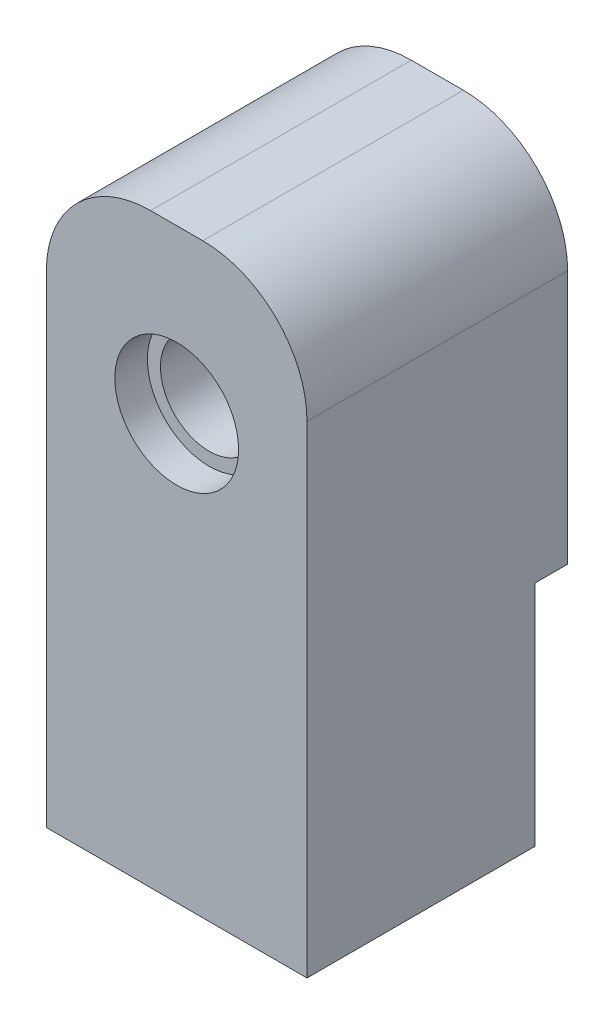
ISO-10303-21;
HEADER;
FILE_DESCRIPTION(('STEP AP214'),'2;1');
FILE_NAME('part.step','',(''),(''),'','','');
FILE_SCHEMA(('AUTOMOTIVE_DESIGN { 1 0 10303 214 1 1 1 1 }'));
ENDSEC;
DATA;
#1=APPLICATION_CONTEXT('core data for automotive mechanical design processes');
#2=APPLICATION_PROTOCOL_DEFINITION('international standard','automotive_design',2000,#1);
#3=PRODUCT_CONTEXT('',#1,'mechanical');
#4=PRODUCT('Part','Part','',(#3));
#5=PRODUCT_RELATED_PRODUCT_CATEGORY('part','',(#4));
#6=PRODUCT_DEFINITION_FORMATION('','',#4);
#7=PRODUCT_DEFINITION_CONTEXT('part definition',#1,'design');
#8=PRODUCT_DEFINITION('design','',#6,#7);
#9=PRODUCT_DEFINITION_SHAPE('','',#8);
#10=(LENGTH_UNIT() NAMED_UNIT(*) SI_UNIT(.MILLI.,.METRE.));
#11=(NAMED_UNIT(*) PLANE_ANGLE_UNIT() SI_UNIT($,.RADIAN.));
#12=(NAMED_UNIT(*) SI_UNIT($,.STERADIAN.) SOLID_ANGLE_UNIT());
#13=UNCERTAINTY_MEASURE_WITH_UNIT(LENGTH_MEASURE(1.E-05),#10,'distance_accuracy_value','');
#14=(GEOMETRIC_REPRESENTATION_CONTEXT(3) GLOBAL_UNCERTAINTY_ASSIGNED_CONTEXT((#13)) GLOBAL_UNIT_ASSIGNED_CONTEXT((#10,
#11,#12)) REPRESENTATION_CONTEXT('',''));
#15=CARTESIAN_POINT('',(0.,0.,0.));
#16=DIRECTION('',(0.,0.,1.));
#17=DIRECTION('',(1.,0.,0.));
#18=AXIS2_PLACEMENT_3D('',#15,#16,#17);
#19=CARTESIAN_POINT('',(12.6999999999999,0.,-5.64920849163501));
#20=DIRECTION('',(0.,1.,0.));
#21=DIRECTION('',(0.,0.,1.));
#22=AXIS2_PLACEMENT_3D('',#19,#20,#21);
#23=PLANE('',#22);
#24=CARTESIAN_POINT('',(0.,0.,3.87579150836499));
#25=DIRECTION('',(0.,-1.,0.));
#26=DIRECTION('',(0.,0.,-1.));
#27=AXIS2_PLACEMENT_3D('',#24,#25,#26);
#28=CIRCLE('',#27,6.35);
#29=CARTESIAN_POINT('',(0.,0.,-2.47420849163501));
#30=VERTEX_POINT('',#29);
#31=EDGE_CURVE('E244',#30,#30,#28,.T.);
#32=ORIENTED_EDGE('',*,*,#31,.F.);
#33=EDGE_LOOP('',(#32));
#34=FACE_BOUND('',#33,.T.);
#35=DIRECTION('',(0.,0.,-1.));
#36=VECTOR('',#35,1.);
#37=CARTESIAN_POINT('',(-12.7,0.,-5.649208491635));
#38=LINE('',#37,#36);
#39=CARTESIAN_POINT('',(-12.7,0.,16.575791508365));
#40=VERTEX_POINT('',#39);
#41=CARTESIAN_POINT('',(-12.7,0.,-5.649208491635));
#42=VERTEX_POINT('',#41);
#43=EDGE_CURVE('E146',#40,#42,#38,.T.);
#44=ORIENTED_EDGE('',*,*,#43,.T.);
#45=DIRECTION('',(-1.,0.,0.));
#46=VECTOR('',#45,1.);
#47=CARTESIAN_POINT('',(12.6999999999999,0.,-5.64920849163501));
#48=LINE('',#47,#46);
#49=CARTESIAN_POINT('',(12.6999999999999,0.,-5.64920849163501));
#50=VERTEX_POINT('',#49);
#51=EDGE_CURVE('E123',#50,#42,#48,.T.);
#52=ORIENTED_EDGE('',*,*,#51,.F.);
#53=DIRECTION('',(0.,0.,-1.));
#54=VECTOR('',#53,1.);
#55=CARTESIAN_POINT('',(12.6999999999999,0.,-5.64920849163501));
#56=LINE('',#55,#54);
#57=CARTESIAN_POINT('',(12.6999999999999,1.2490009027033E-13,16.575791508365));
#58=VERTEX_POINT('',#57);
#59=EDGE_CURVE('E131',#58,#50,#56,.T.);
#60=ORIENTED_EDGE('',*,*,#59,.F.);
#61=DIRECTION('',(-1.,0.,0.));
#62=VECTOR('',#61,1.);
#63=CARTESIAN_POINT('',(12.6999999999999,1.2490009027033E-13,16.575791508365));
#64=LINE('',#63,#62);
#65=EDGE_CURVE('E196',#58,#40,#64,.T.);
#66=ORIENTED_EDGE('',*,*,#65,.T.);
#67=EDGE_LOOP('',(#44,#52,#60,#66));
#68=FACE_BOUND('',#67,.T.);
#69=ADVANCED_FACE('F52',(#34,#68),#23,.F.);
#70=CARTESIAN_POINT('',(12.7,22.2250000000005,-5.64920849163501));
#71=DIRECTION('',(0.,0.,1.));
#72=DIRECTION('',(0.,-1.,0.));
#73=AXIS2_PLACEMENT_3D('',#70,#71,#72);
#74=PLANE('',#73);
#75=DIRECTION('',(0.,1.,0.));
#76=VECTOR('',#75,1.);
#77=CARTESIAN_POINT('',(-12.7000000000001,22.2250000000002,-5.649208491635));
#78=LINE('',#77,#76);
#79=CARTESIAN_POINT('',(-12.7000000000001,22.2250000000002,-5.649208491635));
#80=VERTEX_POINT('',#79);
#81=EDGE_CURVE('E216',#42,#80,#78,.T.);
#82=ORIENTED_EDGE('',*,*,#81,.T.);
#83=DIRECTION('',(-1.,0.,0.));
#84=VECTOR('',#83,1.);
#85=CARTESIAN_POINT('',(12.7,22.2250000000005,-5.64920849163501));
#86=LINE('',#85,#84);
#87=CARTESIAN_POINT('',(12.7,22.2250000000005,-5.64920849163501));
#88=VERTEX_POINT('',#87);
#89=EDGE_CURVE('E126',#88,#80,#86,.T.);
#90=ORIENTED_EDGE('',*,*,#89,.F.);
#91=DIRECTION('',(0.,1.,0.));
#92=VECTOR('',#91,1.);
#93=CARTESIAN_POINT('',(12.7,22.2250000000005,-5.64920849163501));
#94=LINE('',#93,#92);
#95=EDGE_CURVE('E119',#50,#88,#94,.T.);
#96=ORIENTED_EDGE('',*,*,#95,.F.);
#97=ORIENTED_EDGE('',*,*,#51,.T.);
#98=EDGE_LOOP('',(#82,#90,#96,#97));
#99=FACE_BOUND('',#98,.T.);
#100=ADVANCED_FACE('F121',(#99),#74,.F.);
#101=CARTESIAN_POINT('',(12.7,22.2250000000002,-8.82420849163502));
#102=DIRECTION('',(0.,1.,0.));
#103=DIRECTION('',(0.,0.,1.));
#104=AXIS2_PLACEMENT_3D('',#101,#102,#103);
#105=PLANE('',#104);
#106=DIRECTION('',(0.,0.,-1.));
#107=VECTOR('',#106,1.);
#108=CARTESIAN_POINT('',(-12.7,22.2250000000002,-8.82420849163501));
#109=LINE('',#108,#107);
#110=CARTESIAN_POINT('',(-12.7,22.2250000000002,-8.82420849163501));
#111=VERTEX_POINT('',#110);
#112=EDGE_CURVE('E210',#80,#111,#109,.T.);
#113=ORIENTED_EDGE('',*,*,#112,.T.);
#114=DIRECTION('',(-1.,0.,0.));
#115=VECTOR('',#114,1.);
#116=CARTESIAN_POINT('',(12.7,22.2250000000002,-8.82420849163502));
#117=LINE('',#116,#115);
#118=CARTESIAN_POINT('',(12.7,22.2250000000002,-8.82420849163502));
#119=VERTEX_POINT('',#118);
#120=EDGE_CURVE('E155',#119,#111,#117,.T.);
#121=ORIENTED_EDGE('',*,*,#120,.F.);
#122=DIRECTION('',(0.,0.,-1.));
#123=VECTOR('',#122,1.);
#124=CARTESIAN_POINT('',(12.7,22.2250000000002,-8.82420849163502));
#125=LINE('',#124,#123);
#126=EDGE_CURVE('E130',#88,#119,#125,.T.);
#127=ORIENTED_EDGE('',*,*,#126,.F.);
#128=ORIENTED_EDGE('',*,*,#89,.T.);
#129=EDGE_LOOP('',(#113,#121,#127,#128));
#130=FACE_BOUND('',#129,.T.);
#131=ADVANCED_FACE('F266',(#130),#105,.F.);
#132=CARTESIAN_POINT('',(12.6999999999999,57.1499999999999,-8.82420849163501));
#133=DIRECTION('',(0.,0.,1.));
#134=DIRECTION('',(0.,-1.,0.));
#135=AXIS2_PLACEMENT_3D('',#132,#133,#134);
#136=PLANE('',#135);
#137=CARTESIAN_POINT('',(0.,41.275,-8.824208491635));
#138=DIRECTION('',(0.,0.,1.));
#139=DIRECTION('',(1.,0.,0.));
#140=AXIS2_PLACEMENT_3D('',#137,#138,#139);
#141=CIRCLE('',#140,4.7625);
#142=CARTESIAN_POINT('',(4.76249999999995,41.275,-8.824208491635));
#143=VERTEX_POINT('',#142);
#144=EDGE_CURVE('E232',#143,#143,#141,.T.);
#145=ORIENTED_EDGE('',*,*,#144,.T.);
#146=EDGE_LOOP('',(#145));
#147=FACE_BOUND('',#146,.T.);
#148=DIRECTION('',(-1.,0.,0.));
#149=VECTOR('',#148,1.);
#150=CARTESIAN_POINT('',(12.6999999999999,57.1499999999999,-8.82420849163501));
#151=LINE('',#150,#149);
#152=CARTESIAN_POINT('',(2.53999999999999,57.15,-8.824208491635));
#153=VERTEX_POINT('',#152);
#154=CARTESIAN_POINT('',(-2.54000000000013,57.1500000000001,-8.824208491635));
#155=VERTEX_POINT('',#154);
#156=EDGE_CURVE('E179',#153,#155,#151,.T.);
#157=ORIENTED_EDGE('',*,*,#156,.F.);
#158=CARTESIAN_POINT('',(2.53999999999999,46.9900000000001,-8.824208491635));
#159=DIRECTION('',(0.,0.,1.));
#160=DIRECTION('',(0.,-1.,0.));
#161=AXIS2_PLACEMENT_3D('',#158,#159,#160);
#162=CIRCLE('',#161,10.16);
#163=CARTESIAN_POINT('',(12.6999999999999,46.99,-8.824208491635));
#164=VERTEX_POINT('',#163);
#165=EDGE_CURVE('E61',#153,#164,#162,.F.);
#166=ORIENTED_EDGE('',*,*,#165,.T.);
#167=DIRECTION('',(0.,1.,0.));
#168=VECTOR('',#167,1.);
#169=CARTESIAN_POINT('',(12.6999999999999,57.1499999999999,-8.82420849163501));
#170=LINE('',#169,#168);
#171=EDGE_CURVE('E178',#119,#164,#170,.T.);
#172=ORIENTED_EDGE('',*,*,#171,.F.);
#173=ORIENTED_EDGE('',*,*,#120,.T.);
#174=DIRECTION('',(0.,1.,0.));
#175=VECTOR('',#174,1.);
#176=CARTESIAN_POINT('',(-12.7,57.1499999999998,-8.824208491635));
#177=LINE('',#176,#175);
#178=CARTESIAN_POINT('',(-12.7000000000001,46.99,-8.824208491635));
#179=VERTEX_POINT('',#178);
#180=EDGE_CURVE('E206',#111,#179,#177,.T.);
#181=ORIENTED_EDGE('',*,*,#180,.T.);
#182=CARTESIAN_POINT('',(-2.54000000000001,46.9899999999999,-8.824208491635));
#183=DIRECTION('',(0.,0.,1.));
#184=DIRECTION('',(0.,-1.,0.));
#185=AXIS2_PLACEMENT_3D('',#182,#183,#184);
#186=CIRCLE('',#185,10.16);
#187=EDGE_CURVE('E73',#179,#155,#186,.F.);
#188=ORIENTED_EDGE('',*,*,#187,.T.);
#189=EDGE_LOOP('',(#157,#166,#172,#173,#181,#188));
#190=FACE_BOUND('',#189,.T.);
#191=ADVANCED_FACE('F176',(#147,#190),#136,.F.);
#192=CARTESIAN_POINT('',(12.7,57.1499999999998,16.575791508365));
#193=DIRECTION('',(0.,-1.,0.));
#194=DIRECTION('',(0.,0.,-1.));
#195=AXIS2_PLACEMENT_3D('',#192,#193,#194);
#196=PLANE('',#195);
#197=DIRECTION('',(-1.,0.,0.));
#198=VECTOR('',#197,1.);
#199=CARTESIAN_POINT('',(12.7,57.1499999999998,16.575791508365));
#200=LINE('',#199,#198);
#201=CARTESIAN_POINT('',(2.53999999999999,57.15,16.575791508365));
#202=VERTEX_POINT('',#201);
#203=CARTESIAN_POINT('',(-2.54000000000007,57.1500000000001,16.575791508365));
#204=VERTEX_POINT('',#203);
#205=EDGE_CURVE('E191',#202,#204,#200,.T.);
#206=ORIENTED_EDGE('',*,*,#205,.F.);
#207=DIRECTION('',(0.,0.,1.));
#208=VECTOR('',#207,1.);
#209=CARTESIAN_POINT('',(2.53999999999999,57.15,16.575791508365));
#210=LINE('',#209,#208);
#211=EDGE_CURVE('E168',#202,#153,#210,.F.);
#212=ORIENTED_EDGE('',*,*,#211,.T.);
#213=ORIENTED_EDGE('',*,*,#156,.T.);
#214=DIRECTION('',(0.,0.,1.));
#215=VECTOR('',#214,1.);
#216=CARTESIAN_POINT('',(-2.54000000000007,57.1500000000001,16.575791508365));
#217=LINE('',#216,#215);
#218=EDGE_CURVE('E164',#155,#204,#217,.T.);
#219=ORIENTED_EDGE('',*,*,#218,.T.);
#220=EDGE_LOOP('',(#206,#212,#213,#219));
#221=FACE_BOUND('',#220,.T.);
#222=ADVANCED_FACE('F193',(#221),#196,.F.);
#223=CARTESIAN_POINT('',(12.6999999999999,1.2490009027033E-13,16.575791508365));
#224=DIRECTION('',(0.,0.,-1.));
#225=DIRECTION('',(-1.,0.,0.));
#226=AXIS2_PLACEMENT_3D('',#223,#224,#225);
#227=PLANE('',#226);
#228=CARTESIAN_POINT('',(0.,41.275,16.575791508365));
#229=DIRECTION('',(0.,0.,1.));
#230=DIRECTION('',(1.,0.,0.));
#231=AXIS2_PLACEMENT_3D('',#228,#229,#230);
#232=CIRCLE('',#231,6.0325);
#233=CARTESIAN_POINT('',(6.03249999999995,41.275,16.575791508365));
#234=VERTEX_POINT('',#233);
#235=EDGE_CURVE('E228',#234,#234,#232,.T.);
#236=ORIENTED_EDGE('',*,*,#235,.F.);
#237=EDGE_LOOP('',(#236));
#238=FACE_BOUND('',#237,.T.);
#239=DIRECTION('',(0.,-1.,0.));
#240=VECTOR('',#239,1.);
#241=CARTESIAN_POINT('',(12.6999999999999,1.2490009027033E-13,16.575791508365));
#242=LINE('',#241,#240);
#243=CARTESIAN_POINT('',(12.7,46.99,16.575791508365));
#244=VERTEX_POINT('',#243);
#245=EDGE_CURVE('E138',#244,#58,#242,.T.);
#246=ORIENTED_EDGE('',*,*,#245,.F.);
#247=CARTESIAN_POINT('',(2.53999999999988,46.9900000000003,16.575791508365));
#248=DIRECTION('',(0.,0.,-1.));
#249=DIRECTION('',(-1.,0.,0.));
#250=AXIS2_PLACEMENT_3D('',#247,#248,#249);
#251=CIRCLE('',#250,10.16);
#252=EDGE_CURVE('E161',#244,#202,#251,.F.);
#253=ORIENTED_EDGE('',*,*,#252,.T.);
#254=ORIENTED_EDGE('',*,*,#205,.T.);
#255=CARTESIAN_POINT('',(-2.54,46.99,16.575791508365));
#256=DIRECTION('',(0.,0.,-1.));
#257=DIRECTION('',(-1.,0.,0.));
#258=AXIS2_PLACEMENT_3D('',#255,#256,#257);
#259=CIRCLE('',#258,10.16);
#260=CARTESIAN_POINT('',(-12.7000000000001,46.99,16.575791508365));
#261=VERTEX_POINT('',#260);
#262=EDGE_CURVE('E153',#204,#261,#259,.F.);
#263=ORIENTED_EDGE('',*,*,#262,.T.);
#264=DIRECTION('',(0.,-1.,0.));
#265=VECTOR('',#264,1.);
#266=CARTESIAN_POINT('',(-12.7,0.,16.575791508365));
#267=LINE('',#266,#265);
#268=EDGE_CURVE('E143',#261,#40,#267,.T.);
#269=ORIENTED_EDGE('',*,*,#268,.T.);
#270=ORIENTED_EDGE('',*,*,#65,.F.);
#271=EDGE_LOOP('',(#246,#253,#254,#263,#269,#270));
#272=FACE_BOUND('',#271,.T.);
#273=ADVANCED_FACE('F190',(#238,#272),#227,.F.);
#274=CARTESIAN_POINT('',(12.6999999999999,1.2490009027033E-13,0.));
#275=DIRECTION('',(-1.,0.,0.));
#276=DIRECTION('',(0.,0.,1.));
#277=AXIS2_PLACEMENT_3D('',#274,#275,#276);
#278=PLANE('',#277);
#279=ORIENTED_EDGE('',*,*,#171,.T.);
#280=DIRECTION('',(0.,0.,1.));
#281=VECTOR('',#280,1.);
#282=CARTESIAN_POINT('',(12.7,46.99,0.));
#283=LINE('',#282,#281);
#284=EDGE_CURVE('E148',#164,#244,#283,.T.);
#285=ORIENTED_EDGE('',*,*,#284,.T.);
#286=ORIENTED_EDGE('',*,*,#245,.T.);
#287=ORIENTED_EDGE('',*,*,#59,.T.);
#288=ORIENTED_EDGE('',*,*,#95,.T.);
#289=ORIENTED_EDGE('',*,*,#126,.T.);
#290=EDGE_LOOP('',(#279,#285,#286,#287,#288,#289));
#291=FACE_BOUND('',#290,.T.);
#292=ADVANCED_FACE('F135',(#291),#278,.F.);
#293=CARTESIAN_POINT('',(-12.7,0.,0.));
#294=DIRECTION('',(-1.,0.,0.));
#295=DIRECTION('',(0.,0.,1.));
#296=AXIS2_PLACEMENT_3D('',#293,#294,#295);
#297=PLANE('',#296);
#298=ORIENTED_EDGE('',*,*,#268,.F.);
#299=DIRECTION('',(0.,0.,1.));
#300=VECTOR('',#299,1.);
#301=CARTESIAN_POINT('',(-12.7000000000001,46.99,-8.824208491635));
#302=LINE('',#301,#300);
#303=EDGE_CURVE('E13',#261,#179,#302,.F.);
#304=ORIENTED_EDGE('',*,*,#303,.T.);
#305=ORIENTED_EDGE('',*,*,#180,.F.);
#306=ORIENTED_EDGE('',*,*,#112,.F.);
#307=ORIENTED_EDGE('',*,*,#81,.F.);
#308=ORIENTED_EDGE('',*,*,#43,.F.);
#309=EDGE_LOOP('',(#298,#304,#305,#306,#307,#308));
#310=FACE_BOUND('',#309,.T.);
#311=ADVANCED_FACE('F209',(#310),#297,.T.);
#312=CARTESIAN_POINT('',(0.,41.275,13.400791508365));
#313=DIRECTION('',(0.,0.,1.));
#314=DIRECTION('',(1.,0.,0.));
#315=AXIS2_PLACEMENT_3D('',#312,#313,#314);
#316=CYLINDRICAL_SURFACE('',#315,6.0325);
#317=CARTESIAN_POINT('',(0.,41.275,13.400791508365));
#318=DIRECTION('',(0.,0.,1.));
#319=DIRECTION('',(1.,0.,0.));
#320=AXIS2_PLACEMENT_3D('',#317,#318,#319);
#321=CIRCLE('',#320,6.0325);
#322=CARTESIAN_POINT('',(6.03249999999994,41.275,13.400791508365));
#323=VERTEX_POINT('',#322);
#324=EDGE_CURVE('E223',#323,#323,#321,.T.);
#325=ORIENTED_EDGE('',*,*,#324,.F.);
#326=EDGE_LOOP('',(#325));
#327=FACE_BOUND('',#326,.T.);
#328=ORIENTED_EDGE('',*,*,#235,.T.);
#329=EDGE_LOOP('',(#328));
#330=FACE_BOUND('',#329,.T.);
#331=ADVANCED_FACE('F282',(#327,#330),#316,.F.);
#332=CARTESIAN_POINT('',(0.,41.275,13.400791508365));
#333=DIRECTION('',(0.,0.,1.));
#334=DIRECTION('',(1.,0.,0.));
#335=AXIS2_PLACEMENT_3D('',#332,#333,#334);
#336=PLANE('',#335);
#337=CARTESIAN_POINT('',(0.,41.275,13.400791508365));
#338=DIRECTION('',(0.,0.,1.));
#339=DIRECTION('',(1.,0.,0.));
#340=AXIS2_PLACEMENT_3D('',#337,#338,#339);
#341=CIRCLE('',#340,4.7625);
#342=CARTESIAN_POINT('',(4.76249999999995,41.275,13.400791508365));
#343=VERTEX_POINT('',#342);
#344=EDGE_CURVE('E236',#343,#343,#341,.T.);
#345=ORIENTED_EDGE('',*,*,#344,.F.);
#346=EDGE_LOOP('',(#345));
#347=FACE_BOUND('',#346,.T.);
#348=ORIENTED_EDGE('',*,*,#324,.T.);
#349=EDGE_LOOP('',(#348));
#350=FACE_BOUND('',#349,.T.);
#351=ADVANCED_FACE('F276',(#347,#350),#336,.T.);
#352=CARTESIAN_POINT('',(0.,41.275,-8.824208491635));
#353=DIRECTION('',(0.,0.,1.));
#354=DIRECTION('',(1.,0.,0.));
#355=AXIS2_PLACEMENT_3D('',#352,#353,#354);
#356=CYLINDRICAL_SURFACE('',#355,4.7625);
#357=ORIENTED_EDGE('',*,*,#144,.F.);
#358=EDGE_LOOP('',(#357));
#359=FACE_BOUND('',#358,.T.);
#360=ORIENTED_EDGE('',*,*,#344,.T.);
#361=EDGE_LOOP('',(#360));
#362=FACE_BOUND('',#361,.T.);
#363=ADVANCED_FACE('F270',(#359,#362),#356,.F.);
#364=CARTESIAN_POINT('',(2.53999999999986,46.9900000000001,0.));
#365=DIRECTION('',(0.,0.,1.));
#366=DIRECTION('',(1.,0.,0.));
#367=AXIS2_PLACEMENT_3D('',#364,#365,#366);
#368=CYLINDRICAL_SURFACE('',#367,10.16);
#369=ORIENTED_EDGE('',*,*,#165,.F.);
#370=ORIENTED_EDGE('',*,*,#211,.F.);
#371=ORIENTED_EDGE('',*,*,#252,.F.);
#372=ORIENTED_EDGE('',*,*,#284,.F.);
#373=EDGE_LOOP('',(#369,#370,#371,#372));
#374=FACE_BOUND('',#373,.T.);
#375=ADVANCED_FACE('F186',(#374),#368,.T.);
#376=CARTESIAN_POINT('',(-2.54,46.99,16.575791508365));
#377=DIRECTION('',(0.,0.,-1.));
#378=DIRECTION('',(-1.,0.,0.));
#379=AXIS2_PLACEMENT_3D('',#376,#377,#378);
#380=CYLINDRICAL_SURFACE('',#379,10.16);
#381=ORIENTED_EDGE('',*,*,#187,.F.);
#382=ORIENTED_EDGE('',*,*,#303,.F.);
#383=ORIENTED_EDGE('',*,*,#262,.F.);
#384=ORIENTED_EDGE('',*,*,#218,.F.);
#385=EDGE_LOOP('',(#381,#382,#383,#384));
#386=FACE_BOUND('',#385,.T.);
#387=ADVANCED_FACE('F54',(#386),#380,.T.);
#388=CARTESIAN_POINT('',(-2.77555756156289E-13,30.1752,3.87579150836499));
#389=DIRECTION('',(0.,-1.,0.));
#390=DIRECTION('',(0.,0.,-1.));
#391=AXIS2_PLACEMENT_3D('',#388,#389,#390);
#392=CYLINDRICAL_SURFACE('',#391,6.35);
#393=CARTESIAN_POINT('',(-2.77555756156289E-13,30.1752,3.87579150836499));
#394=DIRECTION('',(0.,-1.,0.));
#395=DIRECTION('',(0.,0.,-1.));
#396=AXIS2_PLACEMENT_3D('',#393,#394,#395);
#397=CIRCLE('',#396,6.35);
#398=CARTESIAN_POINT('',(-2.76771160838877E-13,30.1752,-2.47420849163501));
#399=VERTEX_POINT('',#398);
#400=EDGE_CURVE('E240',#399,#399,#397,.T.);
#401=ORIENTED_EDGE('',*,*,#400,.F.);
#402=EDGE_LOOP('',(#401));
#403=FACE_BOUND('',#402,.T.);
#404=ORIENTED_EDGE('',*,*,#31,.T.);
#405=EDGE_LOOP('',(#404));
#406=FACE_BOUND('',#405,.T.);
#407=ADVANCED_FACE('F255',(#403,#406),#392,.F.);
#408=CARTESIAN_POINT('',(-2.77555756156289E-13,30.1752,3.87579150836499));
#409=DIRECTION('',(0.,-1.,0.));
#410=DIRECTION('',(0.,0.,-1.));
#411=AXIS2_PLACEMENT_3D('',#408,#409,#410);
#412=PLANE('',#411);
#413=ORIENTED_EDGE('',*,*,#400,.T.);
#414=EDGE_LOOP('',(#413));
#415=FACE_BOUND('',#414,.T.);
#416=ADVANCED_FACE('F253',(#415),#412,.T.);
#417=CLOSED_SHELL('',(#69,#100,#131,#191,#222,#273,#292,#311,#331,#351,#363,#375,#387,#407,#416));
#418=MANIFOLD_SOLID_BREP('B2',#417);
#419=ADVANCED_BREP_SHAPE_REPRESENTATION('',(#18,#418),#14);
#420=SHAPE_DEFINITION_REPRESENTATION(#9,#419);
ENDSEC;
END-ISO-10303-21;
